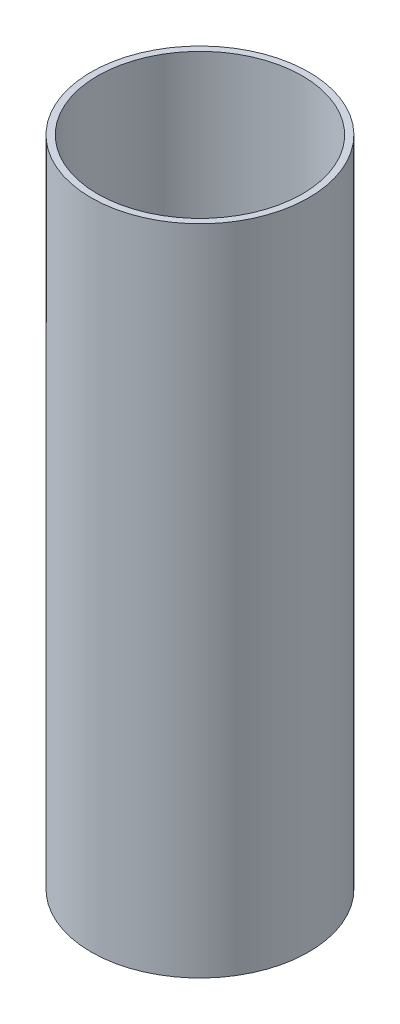
ISO-10303-21;
HEADER;
FILE_DESCRIPTION(('STEP AP214'),'2;1');
FILE_NAME('part.step','',(''),(''),'','','');
FILE_SCHEMA(('AUTOMOTIVE_DESIGN { 1 0 10303 214 1 1 1 1 }'));
ENDSEC;
DATA;
#1=APPLICATION_CONTEXT('core data for automotive mechanical design processes');
#2=APPLICATION_PROTOCOL_DEFINITION('international standard','automotive_design',2000,#1);
#3=PRODUCT_CONTEXT('',#1,'mechanical');
#4=PRODUCT('Part','Part','',(#3));
#5=PRODUCT_RELATED_PRODUCT_CATEGORY('part','',(#4));
#6=PRODUCT_DEFINITION_FORMATION('','',#4);
#7=PRODUCT_DEFINITION_CONTEXT('part definition',#1,'design');
#8=PRODUCT_DEFINITION('design','',#6,#7);
#9=PRODUCT_DEFINITION_SHAPE('','',#8);
#10=(LENGTH_UNIT() NAMED_UNIT(*) SI_UNIT(.MILLI.,.METRE.));
#11=(NAMED_UNIT(*) PLANE_ANGLE_UNIT() SI_UNIT($,.RADIAN.));
#12=(NAMED_UNIT(*) SI_UNIT($,.STERADIAN.) SOLID_ANGLE_UNIT());
#13=UNCERTAINTY_MEASURE_WITH_UNIT(LENGTH_MEASURE(1.E-05),#10,'distance_accuracy_value','');
#14=(GEOMETRIC_REPRESENTATION_CONTEXT(3) GLOBAL_UNCERTAINTY_ASSIGNED_CONTEXT((#13)) GLOBAL_UNIT_ASSIGNED_CONTEXT((#10,
#11,#12)) REPRESENTATION_CONTEXT('',''));
#15=CARTESIAN_POINT('',(0.,0.,0.));
#16=DIRECTION('',(0.,0.,1.));
#17=DIRECTION('',(1.,0.,0.));
#18=AXIS2_PLACEMENT_3D('',#15,#16,#17);
#19=CARTESIAN_POINT('',(0.,0.,0.));
#20=DIRECTION('',(0.,1.,0.));
#21=DIRECTION('',(0.,0.,1.));
#22=AXIS2_PLACEMENT_3D('',#19,#20,#21);
#23=CYLINDRICAL_SURFACE('',#22,6.35);
#24=CARTESIAN_POINT('',(0.,38.1,0.));
#25=DIRECTION('',(0.,1.,0.));
#26=DIRECTION('',(0.,0.,1.));
#27=AXIS2_PLACEMENT_3D('',#24,#25,#26);
#28=CIRCLE('',#27,6.35);
#29=CARTESIAN_POINT('',(0.,38.1,6.35));
#30=VERTEX_POINT('',#29);
#31=EDGE_CURVE('E46',#30,#30,#28,.T.);
#32=ORIENTED_EDGE('',*,*,#31,.F.);
#33=EDGE_LOOP('',(#32));
#34=FACE_BOUND('',#33,.T.);
#35=CARTESIAN_POINT('',(0.,0.,0.));
#36=DIRECTION('',(0.,1.,0.));
#37=DIRECTION('',(0.,0.,1.));
#38=AXIS2_PLACEMENT_3D('',#35,#36,#37);
#39=CIRCLE('',#38,6.35);
#40=CARTESIAN_POINT('',(0.,0.,6.35));
#41=VERTEX_POINT('',#40);
#42=EDGE_CURVE('E37',#41,#41,#39,.T.);
#43=ORIENTED_EDGE('',*,*,#42,.T.);
#44=EDGE_LOOP('',(#43));
#45=FACE_BOUND('',#44,.T.);
#46=ADVANCED_FACE('F34',(#34,#45),#23,.T.);
#47=CARTESIAN_POINT('',(0.,0.,0.));
#48=DIRECTION('',(0.,1.,0.));
#49=DIRECTION('',(0.,0.,1.));
#50=AXIS2_PLACEMENT_3D('',#47,#48,#49);
#51=PLANE('',#50);
#52=CARTESIAN_POINT('',(0.,0.,0.));
#53=DIRECTION('',(0.,1.,0.));
#54=DIRECTION('',(0.,0.,1.));
#55=AXIS2_PLACEMENT_3D('',#52,#53,#54);
#56=CIRCLE('',#55,5.969);
#57=CARTESIAN_POINT('',(0.,0.,5.969));
#58=VERTEX_POINT('',#57);
#59=EDGE_CURVE('E41',#58,#58,#56,.F.);
#60=ORIENTED_EDGE('',*,*,#59,.F.);
#61=EDGE_LOOP('',(#60));
#62=FACE_BOUND('',#61,.T.);
#63=ORIENTED_EDGE('',*,*,#42,.F.);
#64=EDGE_LOOP('',(#63));
#65=FACE_BOUND('',#64,.T.);
#66=ADVANCED_FACE('F55',(#62,#65),#51,.F.);
#67=CARTESIAN_POINT('',(0.,38.1,0.));
#68=DIRECTION('',(0.,1.,0.));
#69=DIRECTION('',(0.,0.,1.));
#70=AXIS2_PLACEMENT_3D('',#67,#68,#69);
#71=PLANE('',#70);
#72=CARTESIAN_POINT('',(0.,38.1,0.));
#73=DIRECTION('',(0.,1.,0.));
#74=DIRECTION('',(0.,0.,1.));
#75=AXIS2_PLACEMENT_3D('',#72,#73,#74);
#76=CIRCLE('',#75,5.969);
#77=CARTESIAN_POINT('',(0.,38.1,5.969));
#78=VERTEX_POINT('',#77);
#79=EDGE_CURVE('E10',#78,#78,#76,.F.);
#80=ORIENTED_EDGE('',*,*,#79,.T.);
#81=EDGE_LOOP('',(#80));
#82=FACE_BOUND('',#81,.T.);
#83=ORIENTED_EDGE('',*,*,#31,.T.);
#84=EDGE_LOOP('',(#83));
#85=FACE_BOUND('',#84,.T.);
#86=ADVANCED_FACE('F57',(#82,#85),#71,.T.);
#87=CARTESIAN_POINT('',(0.,0.,0.));
#88=DIRECTION('',(0.,1.,0.));
#89=DIRECTION('',(0.,0.,1.));
#90=AXIS2_PLACEMENT_3D('',#87,#88,#89);
#91=CYLINDRICAL_SURFACE('',#90,5.969);
#92=ORIENTED_EDGE('',*,*,#79,.F.);
#93=EDGE_LOOP('',(#92));
#94=FACE_BOUND('',#93,.T.);
#95=ORIENTED_EDGE('',*,*,#59,.T.);
#96=EDGE_LOOP('',(#95));
#97=FACE_BOUND('',#96,.T.);
#98=ADVANCED_FACE('F63',(#94,#97),#91,.F.);
#99=CLOSED_SHELL('',(#46,#66,#86,#98));
#100=MANIFOLD_SOLID_BREP('B2',#99);
#101=ADVANCED_BREP_SHAPE_REPRESENTATION('',(#18,#100),#14);
#102=SHAPE_DEFINITION_REPRESENTATION(#9,#101);
ENDSEC;
END-ISO-10303-21;
